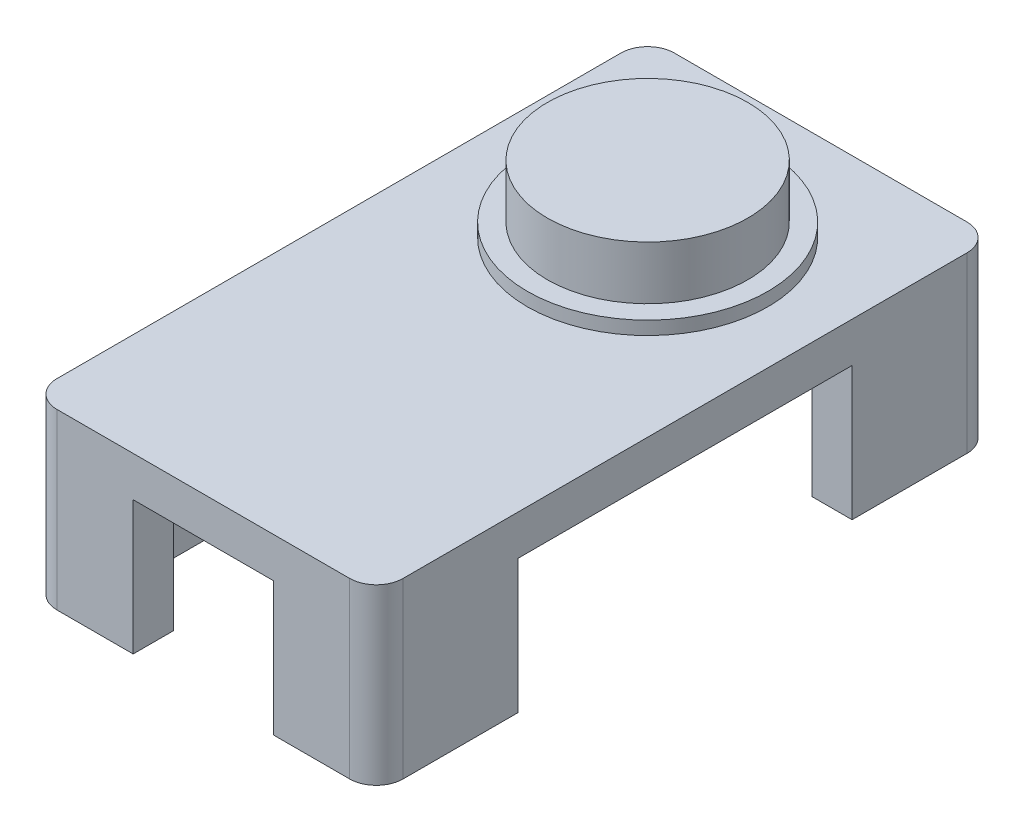
ISO-10303-21;
HEADER;
FILE_DESCRIPTION(('STEP AP214'),'2;1');
FILE_NAME('part.step','',(''),(''),'','','');
FILE_SCHEMA(('AUTOMOTIVE_DESIGN { 1 0 10303 214 1 1 1 1 }'));
ENDSEC;
DATA;
#1=APPLICATION_CONTEXT('core data for automotive mechanical design processes');
#2=APPLICATION_PROTOCOL_DEFINITION('international standard','automotive_design',2000,#1);
#3=PRODUCT_CONTEXT('',#1,'mechanical');
#4=PRODUCT('Part','Part','',(#3));
#5=PRODUCT_RELATED_PRODUCT_CATEGORY('part','',(#4));
#6=PRODUCT_DEFINITION_FORMATION('','',#4);
#7=PRODUCT_DEFINITION_CONTEXT('part definition',#1,'design');
#8=PRODUCT_DEFINITION('design','',#6,#7);
#9=PRODUCT_DEFINITION_SHAPE('','',#8);
#10=(LENGTH_UNIT() NAMED_UNIT(*) SI_UNIT(.MILLI.,.METRE.));
#11=(NAMED_UNIT(*) PLANE_ANGLE_UNIT() SI_UNIT($,.RADIAN.));
#12=(NAMED_UNIT(*) SI_UNIT($,.STERADIAN.) SOLID_ANGLE_UNIT());
#13=UNCERTAINTY_MEASURE_WITH_UNIT(LENGTH_MEASURE(1.E-05),#10,'distance_accuracy_value','');
#14=(GEOMETRIC_REPRESENTATION_CONTEXT(3) GLOBAL_UNCERTAINTY_ASSIGNED_CONTEXT((#13)) GLOBAL_UNIT_ASSIGNED_CONTEXT((#10,
#11,#12)) REPRESENTATION_CONTEXT('',''));
#15=CARTESIAN_POINT('',(0.,0.,0.));
#16=DIRECTION('',(0.,0.,1.));
#17=DIRECTION('',(1.,0.,0.));
#18=AXIS2_PLACEMENT_3D('',#15,#16,#17);
#19=CARTESIAN_POINT('',(0.,0.,0.));
#20=DIRECTION('',(0.,1.,0.));
#21=DIRECTION('',(0.,0.,1.));
#22=AXIS2_PLACEMENT_3D('',#19,#20,#21);
#23=PLANE('',#22);
#24=DIRECTION('',(0.,0.,-1.));
#25=VECTOR('',#24,1.);
#26=CARTESIAN_POINT('',(12.95,0.,-23.1));
#27=LINE('',#26,#25);
#28=CARTESIAN_POINT('',(12.95,0.,21.1));
#29=VERTEX_POINT('',#28);
#30=CARTESIAN_POINT('',(12.95,0.,12.5));
#31=VERTEX_POINT('',#30);
#32=EDGE_CURVE('E245',#29,#31,#27,.T.);
#33=ORIENTED_EDGE('',*,*,#32,.F.);
#34=CARTESIAN_POINT('',(10.95,0.,21.1));
#35=DIRECTION('',(0.,1.,0.));
#36=DIRECTION('',(0.,0.,1.));
#37=AXIS2_PLACEMENT_3D('',#34,#35,#36);
#38=CIRCLE('',#37,2.);
#39=CARTESIAN_POINT('',(10.95,0.,23.1));
#40=VERTEX_POINT('',#39);
#41=EDGE_CURVE('E382',#29,#40,#38,.F.);
#42=ORIENTED_EDGE('',*,*,#41,.T.);
#43=DIRECTION('',(1.,0.,0.));
#44=VECTOR('',#43,1.);
#45=CARTESIAN_POINT('',(-12.95,0.,23.1));
#46=LINE('',#45,#44);
#47=CARTESIAN_POINT('',(5.25,0.,23.1));
#48=VERTEX_POINT('',#47);
#49=EDGE_CURVE('E371',#48,#40,#46,.T.);
#50=ORIENTED_EDGE('',*,*,#49,.F.);
#51=DIRECTION('',(0.,0.,1.));
#52=VECTOR('',#51,1.);
#53=CARTESIAN_POINT('',(5.25,0.,0.));
#54=LINE('',#53,#52);
#55=CARTESIAN_POINT('',(5.25,0.,20.1));
#56=VERTEX_POINT('',#55);
#57=EDGE_CURVE('E302',#56,#48,#54,.T.);
#58=ORIENTED_EDGE('',*,*,#57,.F.);
#59=DIRECTION('',(1.,0.,0.));
#60=VECTOR('',#59,1.);
#61=CARTESIAN_POINT('',(-9.95,0.,20.1));
#62=LINE('',#61,#60);
#63=CARTESIAN_POINT('',(9.95,0.,20.1));
#64=VERTEX_POINT('',#63);
#65=EDGE_CURVE('E348',#56,#64,#62,.T.);
#66=ORIENTED_EDGE('',*,*,#65,.T.);
#67=DIRECTION('',(0.,0.,-1.));
#68=VECTOR('',#67,1.);
#69=CARTESIAN_POINT('',(9.95,0.,-20.1));
#70=LINE('',#69,#68);
#71=CARTESIAN_POINT('',(9.95,0.,12.5));
#72=VERTEX_POINT('',#71);
#73=EDGE_CURVE('E337',#64,#72,#70,.T.);
#74=ORIENTED_EDGE('',*,*,#73,.T.);
#75=DIRECTION('',(-1.,0.,0.));
#76=VECTOR('',#75,1.);
#77=CARTESIAN_POINT('',(0.,0.,12.5));
#78=LINE('',#77,#76);
#79=EDGE_CURVE('E268',#31,#72,#78,.T.);
#80=ORIENTED_EDGE('',*,*,#79,.F.);
#81=EDGE_LOOP('',(#33,#42,#50,#58,#66,#74,#80));
#82=FACE_BOUND('',#81,.T.);
#83=ADVANCED_FACE('F32',(#82),#23,.F.);
#84=DIRECTION('',(-1.,0.,0.));
#85=VECTOR('',#84,1.);
#86=CARTESIAN_POINT('',(-12.95,0.,-23.1));
#87=LINE('',#86,#85);
#88=CARTESIAN_POINT('',(10.95,0.,-23.1));
#89=VERTEX_POINT('',#88);
#90=CARTESIAN_POINT('',(5.25,0.,-23.1));
#91=VERTEX_POINT('',#90);
#92=EDGE_CURVE('E366',#89,#91,#87,.T.);
#93=ORIENTED_EDGE('',*,*,#92,.F.);
#94=CARTESIAN_POINT('',(10.95,0.,-21.1));
#95=DIRECTION('',(0.,1.,0.));
#96=DIRECTION('',(0.,0.,1.));
#97=AXIS2_PLACEMENT_3D('',#94,#95,#96);
#98=CIRCLE('',#97,2.);
#99=CARTESIAN_POINT('',(12.95,0.,-21.1));
#100=VERTEX_POINT('',#99);
#101=EDGE_CURVE('E11',#89,#100,#98,.F.);
#102=ORIENTED_EDGE('',*,*,#101,.T.);
#103=CARTESIAN_POINT('',(12.95,0.,-12.5));
#104=VERTEX_POINT('',#103);
#105=EDGE_CURVE('E363',#104,#100,#27,.T.);
#106=ORIENTED_EDGE('',*,*,#105,.F.);
#107=DIRECTION('',(1.,0.,0.));
#108=VECTOR('',#107,1.);
#109=CARTESIAN_POINT('',(0.,0.,-12.5));
#110=LINE('',#109,#108);
#111=CARTESIAN_POINT('',(9.95,0.,-12.5));
#112=VERTEX_POINT('',#111);
#113=EDGE_CURVE('E260',#112,#104,#110,.T.);
#114=ORIENTED_EDGE('',*,*,#113,.F.);
#115=CARTESIAN_POINT('',(9.95,0.,-20.1));
#116=VERTEX_POINT('',#115);
#117=EDGE_CURVE('E320',#112,#116,#70,.T.);
#118=ORIENTED_EDGE('',*,*,#117,.T.);
#119=DIRECTION('',(-1.,0.,0.));
#120=VECTOR('',#119,1.);
#121=CARTESIAN_POINT('',(-9.95,0.,-20.1));
#122=LINE('',#121,#120);
#123=CARTESIAN_POINT('',(5.25,0.,-20.1));
#124=VERTEX_POINT('',#123);
#125=EDGE_CURVE('E341',#116,#124,#122,.T.);
#126=ORIENTED_EDGE('',*,*,#125,.T.);
#127=EDGE_CURVE('E305',#91,#124,#54,.T.);
#128=ORIENTED_EDGE('',*,*,#127,.F.);
#129=EDGE_LOOP('',(#93,#102,#106,#114,#118,#126,#128));
#130=FACE_BOUND('',#129,.T.);
#131=ADVANCED_FACE('F526',(#130),#23,.F.);
#132=CARTESIAN_POINT('',(-10.95,0.,23.1));
#133=VERTEX_POINT('',#132);
#134=CARTESIAN_POINT('',(-5.25,0.,23.1));
#135=VERTEX_POINT('',#134);
#136=EDGE_CURVE('E372',#133,#135,#46,.T.);
#137=ORIENTED_EDGE('',*,*,#136,.F.);
#138=CARTESIAN_POINT('',(-10.95,0.,21.1));
#139=DIRECTION('',(0.,1.,0.));
#140=DIRECTION('',(0.,0.,1.));
#141=AXIS2_PLACEMENT_3D('',#138,#139,#140);
#142=CIRCLE('',#141,2.);
#143=CARTESIAN_POINT('',(-12.95,0.,21.1));
#144=VERTEX_POINT('',#143);
#145=EDGE_CURVE('E397',#133,#144,#142,.F.);
#146=ORIENTED_EDGE('',*,*,#145,.T.);
#147=DIRECTION('',(0.,0.,1.));
#148=VECTOR('',#147,1.);
#149=CARTESIAN_POINT('',(-12.95,0.,-23.1));
#150=LINE('',#149,#148);
#151=CARTESIAN_POINT('',(-12.95,0.,12.5));
#152=VERTEX_POINT('',#151);
#153=EDGE_CURVE('E368',#152,#144,#150,.T.);
#154=ORIENTED_EDGE('',*,*,#153,.F.);
#155=DIRECTION('',(-1.,0.,0.));
#156=VECTOR('',#155,1.);
#157=CARTESIAN_POINT('',(0.,0.,12.5));
#158=LINE('',#157,#156);
#159=CARTESIAN_POINT('',(-9.95,0.,12.5));
#160=VERTEX_POINT('',#159);
#161=EDGE_CURVE('E265',#160,#152,#158,.T.);
#162=ORIENTED_EDGE('',*,*,#161,.F.);
#163=DIRECTION('',(0.,0.,1.));
#164=VECTOR('',#163,1.);
#165=CARTESIAN_POINT('',(-9.95,0.,-20.1));
#166=LINE('',#165,#164);
#167=CARTESIAN_POINT('',(-9.95,0.,20.1));
#168=VERTEX_POINT('',#167);
#169=EDGE_CURVE('E344',#160,#168,#166,.T.);
#170=ORIENTED_EDGE('',*,*,#169,.T.);
#171=CARTESIAN_POINT('',(-5.25,0.,20.1));
#172=VERTEX_POINT('',#171);
#173=EDGE_CURVE('E349',#168,#172,#62,.T.);
#174=ORIENTED_EDGE('',*,*,#173,.T.);
#175=DIRECTION('',(0.,0.,-1.));
#176=VECTOR('',#175,1.);
#177=CARTESIAN_POINT('',(-5.25,0.,0.));
#178=LINE('',#177,#176);
#179=EDGE_CURVE('E293',#135,#172,#178,.T.);
#180=ORIENTED_EDGE('',*,*,#179,.F.);
#181=EDGE_LOOP('',(#137,#146,#154,#162,#170,#174,#180));
#182=FACE_BOUND('',#181,.T.);
#183=ADVANCED_FACE('F451',(#182),#23,.F.);
#184=CARTESIAN_POINT('',(-12.95,0.,-21.1));
#185=VERTEX_POINT('',#184);
#186=CARTESIAN_POINT('',(-12.95,0.,-12.5));
#187=VERTEX_POINT('',#186);
#188=EDGE_CURVE('E369',#185,#187,#150,.T.);
#189=ORIENTED_EDGE('',*,*,#188,.F.);
#190=CARTESIAN_POINT('',(-10.95,0.,-21.1));
#191=DIRECTION('',(0.,1.,0.));
#192=DIRECTION('',(0.,0.,1.));
#193=AXIS2_PLACEMENT_3D('',#190,#191,#192);
#194=CIRCLE('',#193,2.);
#195=CARTESIAN_POINT('',(-10.95,0.,-23.1));
#196=VERTEX_POINT('',#195);
#197=EDGE_CURVE('E53',#185,#196,#194,.F.);
#198=ORIENTED_EDGE('',*,*,#197,.T.);
#199=CARTESIAN_POINT('',(-5.25,0.,-23.1));
#200=VERTEX_POINT('',#199);
#201=EDGE_CURVE('E365',#200,#196,#87,.T.);
#202=ORIENTED_EDGE('',*,*,#201,.F.);
#203=CARTESIAN_POINT('',(-5.25,0.,-20.1));
#204=VERTEX_POINT('',#203);
#205=EDGE_CURVE('E296',#204,#200,#178,.T.);
#206=ORIENTED_EDGE('',*,*,#205,.F.);
#207=CARTESIAN_POINT('',(-9.95,0.,-20.1));
#208=VERTEX_POINT('',#207);
#209=EDGE_CURVE('E340',#204,#208,#122,.T.);
#210=ORIENTED_EDGE('',*,*,#209,.T.);
#211=CARTESIAN_POINT('',(-9.95,0.,-12.5));
#212=VERTEX_POINT('',#211);
#213=EDGE_CURVE('E345',#208,#212,#166,.T.);
#214=ORIENTED_EDGE('',*,*,#213,.T.);
#215=DIRECTION('',(1.,0.,0.));
#216=VECTOR('',#215,1.);
#217=CARTESIAN_POINT('',(0.,0.,-12.5));
#218=LINE('',#217,#216);
#219=EDGE_CURVE('E250',#187,#212,#218,.T.);
#220=ORIENTED_EDGE('',*,*,#219,.F.);
#221=EDGE_LOOP('',(#189,#198,#202,#206,#210,#214,#220));
#222=FACE_BOUND('',#221,.T.);
#223=ADVANCED_FACE('F425',(#222),#23,.F.);
#224=CARTESIAN_POINT('',(12.95,10.,-23.1));
#225=DIRECTION('',(-1.,0.,0.));
#226=DIRECTION('',(0.,0.,1.));
#227=AXIS2_PLACEMENT_3D('',#224,#225,#226);
#228=PLANE('',#227);
#229=DIRECTION('',(0.,0.,-1.));
#230=VECTOR('',#229,1.);
#231=CARTESIAN_POINT('',(12.95,13.,-23.1));
#232=LINE('',#231,#230);
#233=CARTESIAN_POINT('',(12.95,13.,21.1));
#234=VERTEX_POINT('',#233);
#235=CARTESIAN_POINT('',(12.95,13.,-21.1));
#236=VERTEX_POINT('',#235);
#237=EDGE_CURVE('E308',#234,#236,#232,.T.);
#238=ORIENTED_EDGE('',*,*,#237,.F.);
#239=DIRECTION('',(0.,-1.,0.));
#240=VECTOR('',#239,1.);
#241=CARTESIAN_POINT('',(12.95,10.,21.1));
#242=LINE('',#241,#240);
#243=EDGE_CURVE('E380',#234,#29,#242,.T.);
#244=ORIENTED_EDGE('',*,*,#243,.T.);
#245=ORIENTED_EDGE('',*,*,#32,.T.);
#246=DIRECTION('',(0.,1.,0.));
#247=VECTOR('',#246,1.);
#248=CARTESIAN_POINT('',(12.95,-7.,12.5));
#249=LINE('',#248,#247);
#250=CARTESIAN_POINT('',(12.95,10.,12.5));
#251=VERTEX_POINT('',#250);
#252=EDGE_CURVE('E221',#31,#251,#249,.T.);
#253=ORIENTED_EDGE('',*,*,#252,.T.);
#254=DIRECTION('',(0.,0.,1.));
#255=VECTOR('',#254,1.);
#256=CARTESIAN_POINT('',(12.95,10.,12.5));
#257=LINE('',#256,#255);
#258=CARTESIAN_POINT('',(12.95,10.,-12.5));
#259=VERTEX_POINT('',#258);
#260=EDGE_CURVE('E233',#259,#251,#257,.T.);
#261=ORIENTED_EDGE('',*,*,#260,.F.);
#262=DIRECTION('',(0.,1.,0.));
#263=VECTOR('',#262,1.);
#264=CARTESIAN_POINT('',(12.95,-7.,-12.5));
#265=LINE('',#264,#263);
#266=EDGE_CURVE('E440',#104,#259,#265,.T.);
#267=ORIENTED_EDGE('',*,*,#266,.F.);
#268=ORIENTED_EDGE('',*,*,#105,.T.);
#269=DIRECTION('',(0.,-1.,0.));
#270=VECTOR('',#269,1.);
#271=CARTESIAN_POINT('',(12.95,10.,-21.1));
#272=LINE('',#271,#270);
#273=EDGE_CURVE('E374',#100,#236,#272,.F.);
#274=ORIENTED_EDGE('',*,*,#273,.T.);
#275=EDGE_LOOP('',(#238,#244,#245,#253,#261,#267,#268,#274));
#276=FACE_BOUND('',#275,.T.);
#277=ADVANCED_FACE('F242',(#276),#228,.F.);
#278=CARTESIAN_POINT('',(-12.95,10.,-23.1));
#279=DIRECTION('',(1.,0.,0.));
#280=DIRECTION('',(0.,0.,-1.));
#281=AXIS2_PLACEMENT_3D('',#278,#279,#280);
#282=PLANE('',#281);
#283=ORIENTED_EDGE('',*,*,#153,.T.);
#284=DIRECTION('',(0.,-1.,0.));
#285=VECTOR('',#284,1.);
#286=CARTESIAN_POINT('',(-12.95,10.,21.1));
#287=LINE('',#286,#285);
#288=CARTESIAN_POINT('',(-12.95,13.,21.1));
#289=VERTEX_POINT('',#288);
#290=EDGE_CURVE('E402',#144,#289,#287,.F.);
#291=ORIENTED_EDGE('',*,*,#290,.T.);
#292=DIRECTION('',(0.,0.,1.));
#293=VECTOR('',#292,1.);
#294=CARTESIAN_POINT('',(-12.95,13.,-23.1));
#295=LINE('',#294,#293);
#296=CARTESIAN_POINT('',(-12.95,13.,-21.1));
#297=VERTEX_POINT('',#296);
#298=EDGE_CURVE('E314',#297,#289,#295,.T.);
#299=ORIENTED_EDGE('',*,*,#298,.F.);
#300=DIRECTION('',(0.,-1.,0.));
#301=VECTOR('',#300,1.);
#302=CARTESIAN_POINT('',(-12.95,10.,-21.1));
#303=LINE('',#302,#301);
#304=EDGE_CURVE('E399',#297,#185,#303,.T.);
#305=ORIENTED_EDGE('',*,*,#304,.T.);
#306=ORIENTED_EDGE('',*,*,#188,.T.);
#307=DIRECTION('',(0.,1.,0.));
#308=VECTOR('',#307,1.);
#309=CARTESIAN_POINT('',(-12.95,-7.,-12.5));
#310=LINE('',#309,#308);
#311=CARTESIAN_POINT('',(-12.95,10.,-12.5));
#312=VERTEX_POINT('',#311);
#313=EDGE_CURVE('E252',#187,#312,#310,.T.);
#314=ORIENTED_EDGE('',*,*,#313,.T.);
#315=DIRECTION('',(0.,0.,-1.));
#316=VECTOR('',#315,1.);
#317=CARTESIAN_POINT('',(-12.95,10.,12.5));
#318=LINE('',#317,#316);
#319=CARTESIAN_POINT('',(-12.95,10.,12.5));
#320=VERTEX_POINT('',#319);
#321=EDGE_CURVE('E228',#320,#312,#318,.T.);
#322=ORIENTED_EDGE('',*,*,#321,.F.);
#323=DIRECTION('',(0.,1.,0.));
#324=VECTOR('',#323,1.);
#325=CARTESIAN_POINT('',(-12.95,-7.,12.5));
#326=LINE('',#325,#324);
#327=EDGE_CURVE('E247',#152,#320,#326,.T.);
#328=ORIENTED_EDGE('',*,*,#327,.F.);
#329=EDGE_LOOP('',(#283,#291,#299,#305,#306,#314,#322,#328));
#330=FACE_BOUND('',#329,.T.);
#331=ADVANCED_FACE('F421',(#330),#282,.F.);
#332=CARTESIAN_POINT('',(9.95,10.,-20.1));
#333=DIRECTION('',(-1.,0.,0.));
#334=DIRECTION('',(0.,0.,1.));
#335=AXIS2_PLACEMENT_3D('',#332,#333,#334);
#336=PLANE('',#335);
#337=DIRECTION('',(0.,0.,-1.));
#338=VECTOR('',#337,1.);
#339=CARTESIAN_POINT('',(9.95,10.,-20.1));
#340=LINE('',#339,#338);
#341=CARTESIAN_POINT('',(9.95,10.,20.1));
#342=VERTEX_POINT('',#341);
#343=CARTESIAN_POINT('',(9.95,10.,12.5));
#344=VERTEX_POINT('',#343);
#345=EDGE_CURVE('E321',#342,#344,#340,.T.);
#346=ORIENTED_EDGE('',*,*,#345,.T.);
#347=DIRECTION('',(0.,-1.,0.));
#348=VECTOR('',#347,1.);
#349=CARTESIAN_POINT('',(9.95,10.,12.5));
#350=LINE('',#349,#348);
#351=EDGE_CURVE('E224',#344,#72,#350,.T.);
#352=ORIENTED_EDGE('',*,*,#351,.T.);
#353=ORIENTED_EDGE('',*,*,#73,.F.);
#354=DIRECTION('',(0.,-1.,0.));
#355=VECTOR('',#354,1.);
#356=CARTESIAN_POINT('',(9.95,10.,20.1));
#357=LINE('',#356,#355);
#358=EDGE_CURVE('E336',#342,#64,#357,.T.);
#359=ORIENTED_EDGE('',*,*,#358,.F.);
#360=EDGE_LOOP('',(#346,#352,#353,#359));
#361=FACE_BOUND('',#360,.T.);
#362=ADVANCED_FACE('F472',(#361),#336,.T.);
#363=ORIENTED_EDGE('',*,*,#117,.F.);
#364=DIRECTION('',(0.,1.,0.));
#365=VECTOR('',#364,1.);
#366=CARTESIAN_POINT('',(9.95,10.,-12.5));
#367=LINE('',#366,#365);
#368=CARTESIAN_POINT('',(9.95,10.,-12.5));
#369=VERTEX_POINT('',#368);
#370=EDGE_CURVE('E257',#112,#369,#367,.T.);
#371=ORIENTED_EDGE('',*,*,#370,.T.);
#372=CARTESIAN_POINT('',(9.95,10.,-20.1));
#373=VERTEX_POINT('',#372);
#374=EDGE_CURVE('E324',#369,#373,#340,.T.);
#375=ORIENTED_EDGE('',*,*,#374,.T.);
#376=DIRECTION('',(0.,-1.,0.));
#377=VECTOR('',#376,1.);
#378=CARTESIAN_POINT('',(9.95,10.,-20.1));
#379=LINE('',#378,#377);
#380=EDGE_CURVE('E360',#373,#116,#379,.T.);
#381=ORIENTED_EDGE('',*,*,#380,.T.);
#382=EDGE_LOOP('',(#363,#371,#375,#381));
#383=FACE_BOUND('',#382,.T.);
#384=ADVANCED_FACE('F646',(#383),#336,.T.);
#385=CARTESIAN_POINT('',(-9.95,10.,-20.1));
#386=DIRECTION('',(1.,0.,0.));
#387=DIRECTION('',(0.,0.,-1.));
#388=AXIS2_PLACEMENT_3D('',#385,#386,#387);
#389=PLANE('',#388);
#390=ORIENTED_EDGE('',*,*,#169,.F.);
#391=DIRECTION('',(0.,1.,0.));
#392=VECTOR('',#391,1.);
#393=CARTESIAN_POINT('',(-9.95,10.,12.5));
#394=LINE('',#393,#392);
#395=CARTESIAN_POINT('',(-9.95,10.,12.5));
#396=VERTEX_POINT('',#395);
#397=EDGE_CURVE('E262',#160,#396,#394,.T.);
#398=ORIENTED_EDGE('',*,*,#397,.T.);
#399=DIRECTION('',(0.,0.,1.));
#400=VECTOR('',#399,1.);
#401=CARTESIAN_POINT('',(-9.95,10.,-20.1));
#402=LINE('',#401,#400);
#403=CARTESIAN_POINT('',(-9.95,10.,20.1));
#404=VERTEX_POINT('',#403);
#405=EDGE_CURVE('E328',#396,#404,#402,.T.);
#406=ORIENTED_EDGE('',*,*,#405,.T.);
#407=DIRECTION('',(0.,-1.,0.));
#408=VECTOR('',#407,1.);
#409=CARTESIAN_POINT('',(-9.95,10.,20.1));
#410=LINE('',#409,#408);
#411=EDGE_CURVE('E354',#404,#168,#410,.T.);
#412=ORIENTED_EDGE('',*,*,#411,.T.);
#413=EDGE_LOOP('',(#390,#398,#406,#412));
#414=FACE_BOUND('',#413,.T.);
#415=ADVANCED_FACE('F495',(#414),#389,.T.);
#416=CARTESIAN_POINT('',(-9.95,10.,-20.1));
#417=VERTEX_POINT('',#416);
#418=CARTESIAN_POINT('',(-9.95,10.,-12.5));
#419=VERTEX_POINT('',#418);
#420=EDGE_CURVE('E329',#417,#419,#402,.T.);
#421=ORIENTED_EDGE('',*,*,#420,.T.);
#422=DIRECTION('',(0.,-1.,0.));
#423=VECTOR('',#422,1.);
#424=CARTESIAN_POINT('',(-9.95,10.,-12.5));
#425=LINE('',#424,#423);
#426=EDGE_CURVE('E246',#419,#212,#425,.T.);
#427=ORIENTED_EDGE('',*,*,#426,.T.);
#428=ORIENTED_EDGE('',*,*,#213,.F.);
#429=DIRECTION('',(0.,-1.,0.));
#430=VECTOR('',#429,1.);
#431=CARTESIAN_POINT('',(-9.95,10.,-20.1));
#432=LINE('',#431,#430);
#433=EDGE_CURVE('E357',#417,#208,#432,.T.);
#434=ORIENTED_EDGE('',*,*,#433,.F.);
#435=EDGE_LOOP('',(#421,#427,#428,#434));
#436=FACE_BOUND('',#435,.T.);
#437=ADVANCED_FACE('F432',(#436),#389,.T.);
#438=CARTESIAN_POINT('',(-12.95,10.,-23.1));
#439=DIRECTION('',(0.,0.,1.));
#440=DIRECTION('',(1.,0.,0.));
#441=AXIS2_PLACEMENT_3D('',#438,#439,#440);
#442=PLANE('',#441);
#443=ORIENTED_EDGE('',*,*,#201,.T.);
#444=DIRECTION('',(0.,-1.,0.));
#445=VECTOR('',#444,1.);
#446=CARTESIAN_POINT('',(-10.95,10.,-23.1));
#447=LINE('',#446,#445);
#448=CARTESIAN_POINT('',(-10.95,13.,-23.1));
#449=VERTEX_POINT('',#448);
#450=EDGE_CURVE('E40',#196,#449,#447,.F.);
#451=ORIENTED_EDGE('',*,*,#450,.T.);
#452=DIRECTION('',(-1.,0.,0.));
#453=VECTOR('',#452,1.);
#454=CARTESIAN_POINT('',(-12.95,13.,-23.1));
#455=LINE('',#454,#453);
#456=CARTESIAN_POINT('',(10.95,13.,-23.1));
#457=VERTEX_POINT('',#456);
#458=EDGE_CURVE('E311',#457,#449,#455,.T.);
#459=ORIENTED_EDGE('',*,*,#458,.F.);
#460=DIRECTION('',(0.,-1.,0.));
#461=VECTOR('',#460,1.);
#462=CARTESIAN_POINT('',(10.95,10.,-23.1));
#463=LINE('',#462,#461);
#464=EDGE_CURVE('E405',#457,#89,#463,.T.);
#465=ORIENTED_EDGE('',*,*,#464,.T.);
#466=ORIENTED_EDGE('',*,*,#92,.T.);
#467=DIRECTION('',(0.,1.,0.));
#468=VECTOR('',#467,1.);
#469=CARTESIAN_POINT('',(5.25,-7.,-23.1));
#470=LINE('',#469,#468);
#471=CARTESIAN_POINT('',(5.25,10.,-23.1));
#472=VERTEX_POINT('',#471);
#473=EDGE_CURVE('E280',#91,#472,#470,.T.);
#474=ORIENTED_EDGE('',*,*,#473,.T.);
#475=DIRECTION('',(1.,0.,0.));
#476=VECTOR('',#475,1.);
#477=CARTESIAN_POINT('',(-5.25,10.,-23.1));
#478=LINE('',#477,#476);
#479=CARTESIAN_POINT('',(-5.25,10.,-23.1));
#480=VERTEX_POINT('',#479);
#481=EDGE_CURVE('E278',#480,#472,#478,.T.);
#482=ORIENTED_EDGE('',*,*,#481,.F.);
#483=DIRECTION('',(0.,1.,0.));
#484=VECTOR('',#483,1.);
#485=CARTESIAN_POINT('',(-5.25,-7.,-23.1));
#486=LINE('',#485,#484);
#487=EDGE_CURVE('E283',#200,#480,#486,.T.);
#488=ORIENTED_EDGE('',*,*,#487,.F.);
#489=EDGE_LOOP('',(#443,#451,#459,#465,#466,#474,#482,#488));
#490=FACE_BOUND('',#489,.T.);
#491=ADVANCED_FACE('F409',(#490),#442,.F.);
#492=CARTESIAN_POINT('',(-12.95,10.,23.1));
#493=DIRECTION('',(0.,0.,-1.));
#494=DIRECTION('',(-1.,0.,0.));
#495=AXIS2_PLACEMENT_3D('',#492,#493,#494);
#496=PLANE('',#495);
#497=ORIENTED_EDGE('',*,*,#49,.T.);
#498=DIRECTION('',(0.,-1.,0.));
#499=VECTOR('',#498,1.);
#500=CARTESIAN_POINT('',(10.95,10.,23.1));
#501=LINE('',#500,#499);
#502=CARTESIAN_POINT('',(10.95,13.,23.1));
#503=VERTEX_POINT('',#502);
#504=EDGE_CURVE('E387',#40,#503,#501,.F.);
#505=ORIENTED_EDGE('',*,*,#504,.T.);
#506=DIRECTION('',(1.,0.,0.));
#507=VECTOR('',#506,1.);
#508=CARTESIAN_POINT('',(-12.95,13.,23.1));
#509=LINE('',#508,#507);
#510=CARTESIAN_POINT('',(-10.95,13.,23.1));
#511=VERTEX_POINT('',#510);
#512=EDGE_CURVE('E317',#511,#503,#509,.T.);
#513=ORIENTED_EDGE('',*,*,#512,.F.);
#514=DIRECTION('',(0.,-1.,0.));
#515=VECTOR('',#514,1.);
#516=CARTESIAN_POINT('',(-10.95,10.,23.1));
#517=LINE('',#516,#515);
#518=EDGE_CURVE('E384',#511,#133,#517,.T.);
#519=ORIENTED_EDGE('',*,*,#518,.T.);
#520=ORIENTED_EDGE('',*,*,#136,.T.);
#521=DIRECTION('',(0.,1.,0.));
#522=VECTOR('',#521,1.);
#523=CARTESIAN_POINT('',(-5.25,-7.,23.1));
#524=LINE('',#523,#522);
#525=CARTESIAN_POINT('',(-5.25,10.,23.1));
#526=VERTEX_POINT('',#525);
#527=EDGE_CURVE('E285',#135,#526,#524,.T.);
#528=ORIENTED_EDGE('',*,*,#527,.T.);
#529=DIRECTION('',(-1.,0.,0.));
#530=VECTOR('',#529,1.);
#531=CARTESIAN_POINT('',(-5.25,10.,23.1));
#532=LINE('',#531,#530);
#533=CARTESIAN_POINT('',(5.25,10.,23.1));
#534=VERTEX_POINT('',#533);
#535=EDGE_CURVE('E273',#534,#526,#532,.T.);
#536=ORIENTED_EDGE('',*,*,#535,.F.);
#537=DIRECTION('',(0.,1.,0.));
#538=VECTOR('',#537,1.);
#539=CARTESIAN_POINT('',(5.25,-7.,23.1));
#540=LINE('',#539,#538);
#541=EDGE_CURVE('E288',#48,#534,#540,.T.);
#542=ORIENTED_EDGE('',*,*,#541,.F.);
#543=EDGE_LOOP('',(#497,#505,#513,#519,#520,#528,#536,#542));
#544=FACE_BOUND('',#543,.T.);
#545=ADVANCED_FACE('F461',(#544),#496,.F.);
#546=CARTESIAN_POINT('',(-9.95,10.,-20.1));
#547=DIRECTION('',(0.,0.,1.));
#548=DIRECTION('',(1.,0.,0.));
#549=AXIS2_PLACEMENT_3D('',#546,#547,#548);
#550=PLANE('',#549);
#551=DIRECTION('',(-1.,0.,0.));
#552=VECTOR('',#551,1.);
#553=CARTESIAN_POINT('',(-9.95,10.,-20.1));
#554=LINE('',#553,#552);
#555=CARTESIAN_POINT('',(5.25,10.,-20.1));
#556=VERTEX_POINT('',#555);
#557=EDGE_CURVE('E325',#373,#556,#554,.T.);
#558=ORIENTED_EDGE('',*,*,#557,.T.);
#559=DIRECTION('',(0.,-1.,0.));
#560=VECTOR('',#559,1.);
#561=CARTESIAN_POINT('',(5.25,10.,-20.1));
#562=LINE('',#561,#560);
#563=EDGE_CURVE('E304',#556,#124,#562,.T.);
#564=ORIENTED_EDGE('',*,*,#563,.T.);
#565=ORIENTED_EDGE('',*,*,#125,.F.);
#566=ORIENTED_EDGE('',*,*,#380,.F.);
#567=EDGE_LOOP('',(#558,#564,#565,#566));
#568=FACE_BOUND('',#567,.T.);
#569=ADVANCED_FACE('F715',(#568),#550,.T.);
#570=ORIENTED_EDGE('',*,*,#209,.F.);
#571=DIRECTION('',(0.,1.,0.));
#572=VECTOR('',#571,1.);
#573=CARTESIAN_POINT('',(-5.25,10.,-20.1));
#574=LINE('',#573,#572);
#575=CARTESIAN_POINT('',(-5.25,10.,-20.1));
#576=VERTEX_POINT('',#575);
#577=EDGE_CURVE('E295',#204,#576,#574,.T.);
#578=ORIENTED_EDGE('',*,*,#577,.T.);
#579=EDGE_CURVE('E323',#576,#417,#554,.T.);
#580=ORIENTED_EDGE('',*,*,#579,.T.);
#581=ORIENTED_EDGE('',*,*,#433,.T.);
#582=EDGE_LOOP('',(#570,#578,#580,#581));
#583=FACE_BOUND('',#582,.T.);
#584=ADVANCED_FACE('F707',(#583),#550,.T.);
#585=CARTESIAN_POINT('',(-9.95,10.,20.1));
#586=DIRECTION('',(0.,0.,-1.));
#587=DIRECTION('',(-1.,0.,0.));
#588=AXIS2_PLACEMENT_3D('',#585,#586,#587);
#589=PLANE('',#588);
#590=ORIENTED_EDGE('',*,*,#65,.F.);
#591=DIRECTION('',(0.,1.,0.));
#592=VECTOR('',#591,1.);
#593=CARTESIAN_POINT('',(5.25,10.,20.1));
#594=LINE('',#593,#592);
#595=CARTESIAN_POINT('',(5.25,10.,20.1));
#596=VERTEX_POINT('',#595);
#597=EDGE_CURVE('E299',#56,#596,#594,.T.);
#598=ORIENTED_EDGE('',*,*,#597,.T.);
#599=DIRECTION('',(1.,0.,0.));
#600=VECTOR('',#599,1.);
#601=CARTESIAN_POINT('',(-9.95,10.,20.1));
#602=LINE('',#601,#600);
#603=EDGE_CURVE('E332',#596,#342,#602,.T.);
#604=ORIENTED_EDGE('',*,*,#603,.T.);
#605=ORIENTED_EDGE('',*,*,#358,.T.);
#606=EDGE_LOOP('',(#590,#598,#604,#605));
#607=FACE_BOUND('',#606,.T.);
#608=ADVANCED_FACE('F479',(#607),#589,.T.);
#609=CARTESIAN_POINT('',(-5.25,10.,20.1));
#610=VERTEX_POINT('',#609);
#611=EDGE_CURVE('E333',#404,#610,#602,.T.);
#612=ORIENTED_EDGE('',*,*,#611,.T.);
#613=DIRECTION('',(0.,-1.,0.));
#614=VECTOR('',#613,1.);
#615=CARTESIAN_POINT('',(-5.25,10.,20.1));
#616=LINE('',#615,#614);
#617=EDGE_CURVE('E290',#610,#172,#616,.T.);
#618=ORIENTED_EDGE('',*,*,#617,.T.);
#619=ORIENTED_EDGE('',*,*,#173,.F.);
#620=ORIENTED_EDGE('',*,*,#411,.F.);
#621=EDGE_LOOP('',(#612,#618,#619,#620));
#622=FACE_BOUND('',#621,.T.);
#623=ADVANCED_FACE('F492',(#622),#589,.T.);
#624=CARTESIAN_POINT('',(0.,10.,0.));
#625=DIRECTION('',(0.,1.,0.));
#626=DIRECTION('',(0.,0.,1.));
#627=AXIS2_PLACEMENT_3D('',#624,#625,#626);
#628=PLANE('',#627);
#629=ORIENTED_EDGE('',*,*,#374,.F.);
#630=DIRECTION('',(1.,0.,0.));
#631=VECTOR('',#630,1.);
#632=CARTESIAN_POINT('',(-12.95,10.,-12.5));
#633=LINE('',#632,#631);
#634=EDGE_CURVE('E236',#369,#259,#633,.T.);
#635=ORIENTED_EDGE('',*,*,#634,.T.);
#636=ORIENTED_EDGE('',*,*,#260,.T.);
#637=DIRECTION('',(-1.,0.,0.));
#638=VECTOR('',#637,1.);
#639=CARTESIAN_POINT('',(-12.95,10.,12.5));
#640=LINE('',#639,#638);
#641=EDGE_CURVE('E217',#251,#344,#640,.T.);
#642=ORIENTED_EDGE('',*,*,#641,.T.);
#643=ORIENTED_EDGE('',*,*,#345,.F.);
#644=ORIENTED_EDGE('',*,*,#603,.F.);
#645=DIRECTION('',(0.,0.,1.));
#646=VECTOR('',#645,1.);
#647=CARTESIAN_POINT('',(5.25,10.,23.1));
#648=LINE('',#647,#646);
#649=EDGE_CURVE('E270',#596,#534,#648,.T.);
#650=ORIENTED_EDGE('',*,*,#649,.T.);
#651=ORIENTED_EDGE('',*,*,#535,.T.);
#652=DIRECTION('',(0.,0.,-1.));
#653=VECTOR('',#652,1.);
#654=CARTESIAN_POINT('',(-5.25,10.,23.1));
#655=LINE('',#654,#653);
#656=EDGE_CURVE('E276',#526,#610,#655,.T.);
#657=ORIENTED_EDGE('',*,*,#656,.T.);
#658=ORIENTED_EDGE('',*,*,#611,.F.);
#659=ORIENTED_EDGE('',*,*,#405,.F.);
#660=EDGE_CURVE('E229',#396,#320,#640,.T.);
#661=ORIENTED_EDGE('',*,*,#660,.T.);
#662=ORIENTED_EDGE('',*,*,#321,.T.);
#663=EDGE_CURVE('E437',#312,#419,#633,.T.);
#664=ORIENTED_EDGE('',*,*,#663,.T.);
#665=ORIENTED_EDGE('',*,*,#420,.F.);
#666=ORIENTED_EDGE('',*,*,#579,.F.);
#667=EDGE_CURVE('E275',#576,#480,#655,.T.);
#668=ORIENTED_EDGE('',*,*,#667,.T.);
#669=ORIENTED_EDGE('',*,*,#481,.T.);
#670=EDGE_CURVE('E271',#472,#556,#648,.T.);
#671=ORIENTED_EDGE('',*,*,#670,.T.);
#672=ORIENTED_EDGE('',*,*,#557,.F.);
#673=EDGE_LOOP('',(#629,#635,#636,#642,#643,#644,#650,#651,#657,#658,#659,#661,#662,#664,#665,
#666,#668,#669,#671,#672));
#674=FACE_BOUND('',#673,.T.);
#675=ADVANCED_FACE('F235',(#674),#628,.F.);
#676=CARTESIAN_POINT('',(0.,13.,0.));
#677=DIRECTION('',(0.,1.,0.));
#678=DIRECTION('',(0.,0.,1.));
#679=AXIS2_PLACEMENT_3D('',#676,#677,#678);
#680=PLANE('',#679);
#681=CARTESIAN_POINT('',(0.,13.,-10.15));
#682=DIRECTION('',(0.,1.,0.));
#683=DIRECTION('',(0.,0.,1.));
#684=AXIS2_PLACEMENT_3D('',#681,#682,#683);
#685=CIRCLE('',#684,9.);
#686=CARTESIAN_POINT('',(0.,13.,-1.15));
#687=VERTEX_POINT('',#686);
#688=EDGE_CURVE('E500',#687,#687,#685,.T.);
#689=ORIENTED_EDGE('',*,*,#688,.F.);
#690=EDGE_LOOP('',(#689));
#691=FACE_BOUND('',#690,.T.);
#692=ORIENTED_EDGE('',*,*,#512,.T.);
#693=CARTESIAN_POINT('',(10.95,13.,21.1));
#694=DIRECTION('',(0.,1.,0.));
#695=DIRECTION('',(0.,0.,1.));
#696=AXIS2_PLACEMENT_3D('',#693,#694,#695);
#697=CIRCLE('',#696,2.);
#698=EDGE_CURVE('E395',#503,#234,#697,.T.);
#699=ORIENTED_EDGE('',*,*,#698,.T.);
#700=ORIENTED_EDGE('',*,*,#237,.T.);
#701=CARTESIAN_POINT('',(10.95,13.,-21.1));
#702=DIRECTION('',(0.,1.,0.));
#703=DIRECTION('',(0.,0.,1.));
#704=AXIS2_PLACEMENT_3D('',#701,#702,#703);
#705=CIRCLE('',#704,2.);
#706=EDGE_CURVE('E389',#236,#457,#705,.T.);
#707=ORIENTED_EDGE('',*,*,#706,.T.);
#708=ORIENTED_EDGE('',*,*,#458,.T.);
#709=CARTESIAN_POINT('',(-10.95,13.,-21.1));
#710=DIRECTION('',(0.,1.,0.));
#711=DIRECTION('',(0.,0.,1.));
#712=AXIS2_PLACEMENT_3D('',#709,#710,#711);
#713=CIRCLE('',#712,2.);
#714=EDGE_CURVE('E391',#449,#297,#713,.T.);
#715=ORIENTED_EDGE('',*,*,#714,.T.);
#716=ORIENTED_EDGE('',*,*,#298,.T.);
#717=CARTESIAN_POINT('',(-10.95,13.,21.1));
#718=DIRECTION('',(0.,1.,0.));
#719=DIRECTION('',(0.,0.,1.));
#720=AXIS2_PLACEMENT_3D('',#717,#718,#719);
#721=CIRCLE('',#720,2.);
#722=EDGE_CURVE('E393',#289,#511,#721,.T.);
#723=ORIENTED_EDGE('',*,*,#722,.T.);
#724=EDGE_LOOP('',(#692,#699,#700,#707,#708,#715,#716,#723));
#725=FACE_BOUND('',#724,.T.);
#726=ADVANCED_FACE('F414',(#691,#725),#680,.T.);
#727=CARTESIAN_POINT('',(-5.25,-7.,23.1));
#728=DIRECTION('',(1.,0.,0.));
#729=DIRECTION('',(0.,0.,-1.));
#730=AXIS2_PLACEMENT_3D('',#727,#728,#729);
#731=PLANE('',#730);
#732=ORIENTED_EDGE('',*,*,#179,.T.);
#733=ORIENTED_EDGE('',*,*,#617,.F.);
#734=ORIENTED_EDGE('',*,*,#656,.F.);
#735=ORIENTED_EDGE('',*,*,#527,.F.);
#736=EDGE_LOOP('',(#732,#733,#734,#735));
#737=FACE_BOUND('',#736,.T.);
#738=ADVANCED_FACE('F488',(#737),#731,.T.);
#739=CARTESIAN_POINT('',(5.25,-7.,23.1));
#740=DIRECTION('',(-1.,0.,0.));
#741=DIRECTION('',(0.,0.,1.));
#742=AXIS2_PLACEMENT_3D('',#739,#740,#741);
#743=PLANE('',#742);
#744=ORIENTED_EDGE('',*,*,#57,.T.);
#745=ORIENTED_EDGE('',*,*,#541,.T.);
#746=ORIENTED_EDGE('',*,*,#649,.F.);
#747=ORIENTED_EDGE('',*,*,#597,.F.);
#748=EDGE_LOOP('',(#744,#745,#746,#747));
#749=FACE_BOUND('',#748,.T.);
#750=ADVANCED_FACE('F482',(#749),#743,.T.);
#751=ORIENTED_EDGE('',*,*,#127,.T.);
#752=ORIENTED_EDGE('',*,*,#563,.F.);
#753=ORIENTED_EDGE('',*,*,#670,.F.);
#754=ORIENTED_EDGE('',*,*,#473,.F.);
#755=EDGE_LOOP('',(#751,#752,#753,#754));
#756=FACE_BOUND('',#755,.T.);
#757=ADVANCED_FACE('F669',(#756),#743,.T.);
#758=ORIENTED_EDGE('',*,*,#205,.T.);
#759=ORIENTED_EDGE('',*,*,#487,.T.);
#760=ORIENTED_EDGE('',*,*,#667,.F.);
#761=ORIENTED_EDGE('',*,*,#577,.F.);
#762=EDGE_LOOP('',(#758,#759,#760,#761));
#763=FACE_BOUND('',#762,.T.);
#764=ADVANCED_FACE('F522',(#763),#731,.T.);
#765=CARTESIAN_POINT('',(-12.95,-7.,-12.5));
#766=DIRECTION('',(0.,0.,1.));
#767=DIRECTION('',(1.,0.,0.));
#768=AXIS2_PLACEMENT_3D('',#765,#766,#767);
#769=PLANE('',#768);
#770=ORIENTED_EDGE('',*,*,#219,.T.);
#771=ORIENTED_EDGE('',*,*,#426,.F.);
#772=ORIENTED_EDGE('',*,*,#663,.F.);
#773=ORIENTED_EDGE('',*,*,#313,.F.);
#774=EDGE_LOOP('',(#770,#771,#772,#773));
#775=FACE_BOUND('',#774,.T.);
#776=ADVANCED_FACE('F429',(#775),#769,.T.);
#777=CARTESIAN_POINT('',(-12.95,-7.,12.5));
#778=DIRECTION('',(0.,0.,-1.));
#779=DIRECTION('',(-1.,0.,0.));
#780=AXIS2_PLACEMENT_3D('',#777,#778,#779);
#781=PLANE('',#780);
#782=ORIENTED_EDGE('',*,*,#161,.T.);
#783=ORIENTED_EDGE('',*,*,#327,.T.);
#784=ORIENTED_EDGE('',*,*,#660,.F.);
#785=ORIENTED_EDGE('',*,*,#397,.F.);
#786=EDGE_LOOP('',(#782,#783,#784,#785));
#787=FACE_BOUND('',#786,.T.);
#788=ADVANCED_FACE('F496',(#787),#781,.T.);
#789=ORIENTED_EDGE('',*,*,#79,.T.);
#790=ORIENTED_EDGE('',*,*,#351,.F.);
#791=ORIENTED_EDGE('',*,*,#641,.F.);
#792=ORIENTED_EDGE('',*,*,#252,.F.);
#793=EDGE_LOOP('',(#789,#790,#791,#792));
#794=FACE_BOUND('',#793,.T.);
#795=ADVANCED_FACE('F219',(#794),#781,.T.);
#796=ORIENTED_EDGE('',*,*,#113,.T.);
#797=ORIENTED_EDGE('',*,*,#266,.T.);
#798=ORIENTED_EDGE('',*,*,#634,.F.);
#799=ORIENTED_EDGE('',*,*,#370,.F.);
#800=EDGE_LOOP('',(#796,#797,#798,#799));
#801=FACE_BOUND('',#800,.T.);
#802=ADVANCED_FACE('F511',(#801),#769,.T.);
#803=CARTESIAN_POINT('',(0.,14.,-10.15));
#804=DIRECTION('',(0.,-1.,0.));
#805=DIRECTION('',(0.,0.,-1.));
#806=AXIS2_PLACEMENT_3D('',#803,#804,#805);
#807=CYLINDRICAL_SURFACE('',#806,9.);
#808=CARTESIAN_POINT('',(0.,14.,-10.15));
#809=DIRECTION('',(0.,1.,0.));
#810=DIRECTION('',(0.,0.,1.));
#811=AXIS2_PLACEMENT_3D('',#808,#809,#810);
#812=CIRCLE('',#811,9.);
#813=CARTESIAN_POINT('',(0.,14.,-1.15));
#814=VERTEX_POINT('',#813);
#815=EDGE_CURVE('E378',#814,#814,#812,.T.);
#816=ORIENTED_EDGE('',*,*,#815,.F.);
#817=EDGE_LOOP('',(#816));
#818=FACE_BOUND('',#817,.T.);
#819=ORIENTED_EDGE('',*,*,#688,.T.);
#820=EDGE_LOOP('',(#819));
#821=FACE_BOUND('',#820,.T.);
#822=ADVANCED_FACE('F508',(#818,#821),#807,.T.);
#823=CARTESIAN_POINT('',(0.,14.,-10.15));
#824=DIRECTION('',(0.,1.,0.));
#825=DIRECTION('',(0.,0.,1.));
#826=AXIS2_PLACEMENT_3D('',#823,#824,#825);
#827=PLANE('',#826);
#828=CARTESIAN_POINT('',(0.,14.,-10.15));
#829=DIRECTION('',(0.,1.,0.));
#830=DIRECTION('',(0.,0.,1.));
#831=AXIS2_PLACEMENT_3D('',#828,#829,#830);
#832=CIRCLE('',#831,7.5);
#833=CARTESIAN_POINT('',(0.,14.,-2.65));
#834=VERTEX_POINT('',#833);
#835=EDGE_CURVE('E375',#834,#834,#832,.T.);
#836=ORIENTED_EDGE('',*,*,#835,.F.);
#837=EDGE_LOOP('',(#836));
#838=FACE_BOUND('',#837,.T.);
#839=ORIENTED_EDGE('',*,*,#815,.T.);
#840=EDGE_LOOP('',(#839));
#841=FACE_BOUND('',#840,.T.);
#842=ADVANCED_FACE('F506',(#838,#841),#827,.T.);
#843=CARTESIAN_POINT('',(0.,18.,-10.15));
#844=DIRECTION('',(0.,1.,0.));
#845=DIRECTION('',(0.,0.,1.));
#846=AXIS2_PLACEMENT_3D('',#843,#844,#845);
#847=PLANE('',#846);
#848=CARTESIAN_POINT('',(0.,18.,-10.15));
#849=DIRECTION('',(0.,1.,0.));
#850=DIRECTION('',(0.,0.,1.));
#851=AXIS2_PLACEMENT_3D('',#848,#849,#850);
#852=CIRCLE('',#851,7.5);
#853=CARTESIAN_POINT('',(0.,18.,-2.65));
#854=VERTEX_POINT('',#853);
#855=EDGE_CURVE('E239',#854,#854,#852,.T.);
#856=ORIENTED_EDGE('',*,*,#855,.T.);
#857=EDGE_LOOP('',(#856));
#858=FACE_BOUND('',#857,.T.);
#859=ADVANCED_FACE('F561',(#858),#847,.T.);
#860=CARTESIAN_POINT('',(0.,18.,-10.15));
#861=DIRECTION('',(0.,-1.,0.));
#862=DIRECTION('',(0.,0.,-1.));
#863=AXIS2_PLACEMENT_3D('',#860,#861,#862);
#864=CYLINDRICAL_SURFACE('',#863,7.5);
#865=ORIENTED_EDGE('',*,*,#835,.T.);
#866=EDGE_LOOP('',(#865));
#867=FACE_BOUND('',#866,.T.);
#868=ORIENTED_EDGE('',*,*,#855,.F.);
#869=EDGE_LOOP('',(#868));
#870=FACE_BOUND('',#869,.T.);
#871=ADVANCED_FACE('F556',(#867,#870),#864,.T.);
#872=CARTESIAN_POINT('',(10.95,10.,21.1));
#873=DIRECTION('',(0.,-1.,0.));
#874=DIRECTION('',(0.,0.,-1.));
#875=AXIS2_PLACEMENT_3D('',#872,#873,#874);
#876=CYLINDRICAL_SURFACE('',#875,2.);
#877=ORIENTED_EDGE('',*,*,#698,.F.);
#878=ORIENTED_EDGE('',*,*,#504,.F.);
#879=ORIENTED_EDGE('',*,*,#41,.F.);
#880=ORIENTED_EDGE('',*,*,#243,.F.);
#881=EDGE_LOOP('',(#877,#878,#879,#880));
#882=FACE_BOUND('',#881,.T.);
#883=ADVANCED_FACE('F467',(#882),#876,.T.);
#884=CARTESIAN_POINT('',(-10.95,10.,21.1));
#885=DIRECTION('',(0.,-1.,0.));
#886=DIRECTION('',(0.,0.,-1.));
#887=AXIS2_PLACEMENT_3D('',#884,#885,#886);
#888=CYLINDRICAL_SURFACE('',#887,2.);
#889=ORIENTED_EDGE('',*,*,#722,.F.);
#890=ORIENTED_EDGE('',*,*,#290,.F.);
#891=ORIENTED_EDGE('',*,*,#145,.F.);
#892=ORIENTED_EDGE('',*,*,#518,.F.);
#893=EDGE_LOOP('',(#889,#890,#891,#892));
#894=FACE_BOUND('',#893,.T.);
#895=ADVANCED_FACE('F457',(#894),#888,.T.);
#896=CARTESIAN_POINT('',(-10.95,10.,-21.1));
#897=DIRECTION('',(0.,-1.,0.));
#898=DIRECTION('',(0.,0.,-1.));
#899=AXIS2_PLACEMENT_3D('',#896,#897,#898);
#900=CYLINDRICAL_SURFACE('',#899,2.);
#901=ORIENTED_EDGE('',*,*,#714,.F.);
#902=ORIENTED_EDGE('',*,*,#450,.F.);
#903=ORIENTED_EDGE('',*,*,#197,.F.);
#904=ORIENTED_EDGE('',*,*,#304,.F.);
#905=EDGE_LOOP('',(#901,#902,#903,#904));
#906=FACE_BOUND('',#905,.T.);
#907=ADVANCED_FACE('F418',(#906),#900,.T.);
#908=CARTESIAN_POINT('',(10.95,10.,-21.1));
#909=DIRECTION('',(0.,-1.,0.));
#910=DIRECTION('',(0.,0.,-1.));
#911=AXIS2_PLACEMENT_3D('',#908,#909,#910);
#912=CYLINDRICAL_SURFACE('',#911,2.);
#913=ORIENTED_EDGE('',*,*,#706,.F.);
#914=ORIENTED_EDGE('',*,*,#273,.F.);
#915=ORIENTED_EDGE('',*,*,#101,.F.);
#916=ORIENTED_EDGE('',*,*,#464,.F.);
#917=EDGE_LOOP('',(#913,#914,#915,#916));
#918=FACE_BOUND('',#917,.T.);
#919=ADVANCED_FACE('F34',(#918),#912,.T.);
#920=CLOSED_SHELL('',(#83,#131,#183,#223,#277,#331,#362,#384,#415,#437,#491,#545,#569,#584,#608,
#623,#675,#726,#738,#750,#757,#764,#776,#788,#795,#802,#822,#842,#859,#871,#883,#895,#907,#919));
#921=MANIFOLD_SOLID_BREP('B2',#920);
#922=ADVANCED_BREP_SHAPE_REPRESENTATION('',(#18,#921),#14);
#923=SHAPE_DEFINITION_REPRESENTATION(#9,#922);
ENDSEC;
END-ISO-10303-21;
